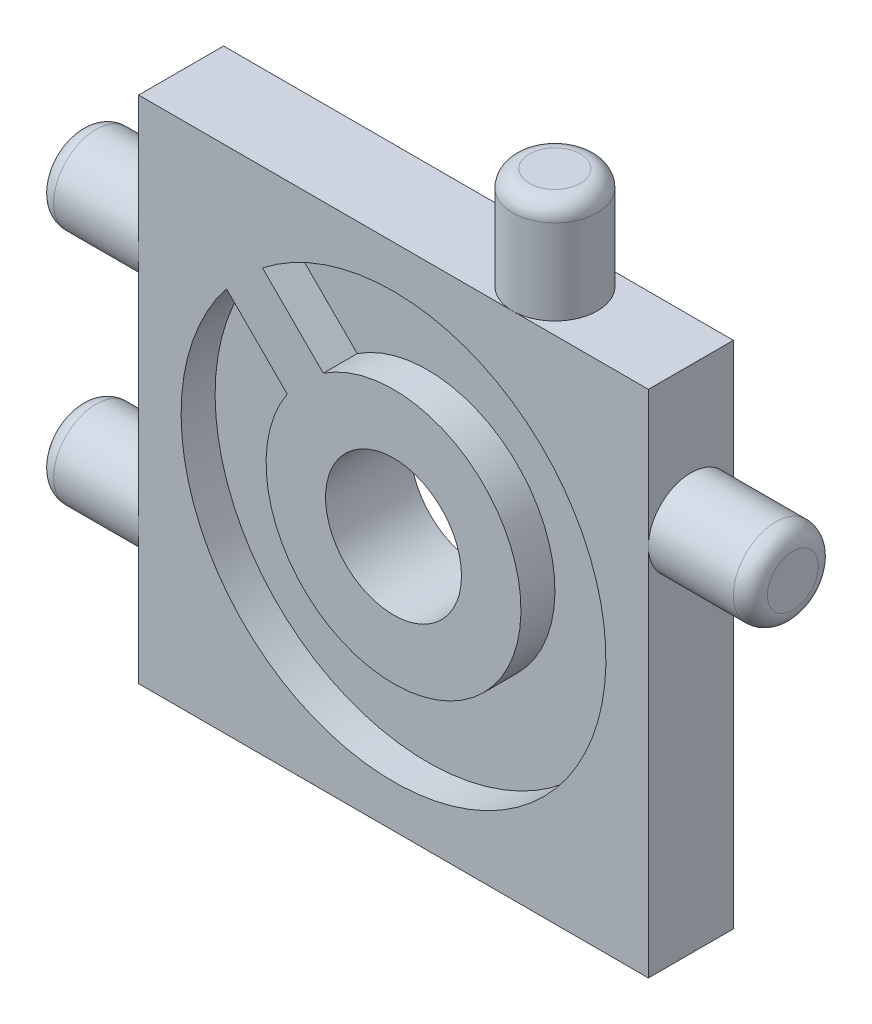
ISO-10303-21;
HEADER;
FILE_DESCRIPTION(('STEP AP214'),'2;1');
FILE_NAME('part.step','',(''),(''),'','','');
FILE_SCHEMA(('AUTOMOTIVE_DESIGN { 1 0 10303 214 1 1 1 1 }'));
ENDSEC;
DATA;
#1=APPLICATION_CONTEXT('core data for automotive mechanical design processes');
#2=APPLICATION_PROTOCOL_DEFINITION('international standard','automotive_design',2000,#1);
#3=PRODUCT_CONTEXT('',#1,'mechanical');
#4=PRODUCT('Part','Part','',(#3));
#5=PRODUCT_RELATED_PRODUCT_CATEGORY('part','',(#4));
#6=PRODUCT_DEFINITION_FORMATION('','',#4);
#7=PRODUCT_DEFINITION_CONTEXT('part definition',#1,'design');
#8=PRODUCT_DEFINITION('design','',#6,#7);
#9=PRODUCT_DEFINITION_SHAPE('','',#8);
#10=(LENGTH_UNIT() NAMED_UNIT(*) SI_UNIT(.MILLI.,.METRE.));
#11=(NAMED_UNIT(*) PLANE_ANGLE_UNIT() SI_UNIT($,.RADIAN.));
#12=(NAMED_UNIT(*) SI_UNIT($,.STERADIAN.) SOLID_ANGLE_UNIT());
#13=UNCERTAINTY_MEASURE_WITH_UNIT(LENGTH_MEASURE(1.E-05),#10,'distance_accuracy_value','');
#14=(GEOMETRIC_REPRESENTATION_CONTEXT(3) GLOBAL_UNCERTAINTY_ASSIGNED_CONTEXT((#13)) GLOBAL_UNIT_ASSIGNED_CONTEXT((#10,
#11,#12)) REPRESENTATION_CONTEXT('',''));
#15=CARTESIAN_POINT('',(0.,0.,0.));
#16=DIRECTION('',(0.,0.,1.));
#17=DIRECTION('',(1.,0.,0.));
#18=AXIS2_PLACEMENT_3D('',#15,#16,#17);
#19=CARTESIAN_POINT('',(0.,0.,0.));
#20=DIRECTION('',(0.,0.,1.));
#21=DIRECTION('',(1.,0.,0.));
#22=AXIS2_PLACEMENT_3D('',#19,#20,#21);
#23=PLANE('',#22);
#24=DIRECTION('',(0.,-1.,0.));
#25=VECTOR('',#24,1.);
#26=CARTESIAN_POINT('',(-15.,15.,0.));
#27=LINE('',#26,#25);
#28=CARTESIAN_POINT('',(-15.,15.,0.));
#29=VERTEX_POINT('',#28);
#30=CARTESIAN_POINT('',(-15.,7.,0.));
#31=VERTEX_POINT('',#30);
#32=EDGE_CURVE('E247',#29,#31,#27,.T.);
#33=ORIENTED_EDGE('',*,*,#32,.F.);
#34=DIRECTION('',(1.,0.,0.));
#35=VECTOR('',#34,1.);
#36=CARTESIAN_POINT('',(-15.,15.,0.));
#37=LINE('',#36,#35);
#38=CARTESIAN_POINT('',(7.,15.,0.));
#39=VERTEX_POINT('',#38);
#40=EDGE_CURVE('E259',#29,#39,#37,.T.);
#41=ORIENTED_EDGE('',*,*,#40,.T.);
#42=CARTESIAN_POINT('',(15.,15.,0.));
#43=VERTEX_POINT('',#42);
#44=EDGE_CURVE('E258',#39,#43,#37,.T.);
#45=ORIENTED_EDGE('',*,*,#44,.T.);
#46=DIRECTION('',(0.,-1.,0.));
#47=VECTOR('',#46,1.);
#48=CARTESIAN_POINT('',(15.,15.,0.));
#49=LINE('',#48,#47);
#50=CARTESIAN_POINT('',(15.,6.99999999999999,0.));
#51=VERTEX_POINT('',#50);
#52=EDGE_CURVE('E255',#43,#51,#49,.T.);
#53=ORIENTED_EDGE('',*,*,#52,.T.);
#54=CARTESIAN_POINT('',(15.,-15.,0.));
#55=VERTEX_POINT('',#54);
#56=EDGE_CURVE('E254',#51,#55,#49,.T.);
#57=ORIENTED_EDGE('',*,*,#56,.T.);
#58=DIRECTION('',(1.,0.,0.));
#59=VECTOR('',#58,1.);
#60=CARTESIAN_POINT('',(-15.,-15.,0.));
#61=LINE('',#60,#59);
#62=CARTESIAN_POINT('',(-15.,-15.,0.));
#63=VERTEX_POINT('',#62);
#64=EDGE_CURVE('E250',#63,#55,#61,.T.);
#65=ORIENTED_EDGE('',*,*,#64,.F.);
#66=CARTESIAN_POINT('',(-15.,-7.,0.));
#67=VERTEX_POINT('',#66);
#68=EDGE_CURVE('E231',#67,#63,#27,.T.);
#69=ORIENTED_EDGE('',*,*,#68,.F.);
#70=EDGE_CURVE('E251',#31,#67,#27,.T.);
#71=ORIENTED_EDGE('',*,*,#70,.F.);
#72=EDGE_LOOP('',(#33,#41,#45,#53,#57,#65,#69,#71));
#73=FACE_BOUND('',#72,.T.);
#74=CARTESIAN_POINT('',(0.,0.,0.));
#75=DIRECTION('',(0.,0.,1.));
#76=DIRECTION('',(1.,0.,0.));
#77=AXIS2_PLACEMENT_3D('',#74,#75,#76);
#78=CIRCLE('',#77,4.);
#79=CARTESIAN_POINT('',(4.,0.,0.));
#80=VERTEX_POINT('',#79);
#81=EDGE_CURVE('E204',#80,#80,#78,.T.);
#82=ORIENTED_EDGE('',*,*,#81,.T.);
#83=EDGE_LOOP('',(#82));
#84=FACE_BOUND('',#83,.T.);
#85=DIRECTION('',(0.707106781186547,0.707106781186548,0.));
#86=VECTOR('',#85,1.);
#87=CARTESIAN_POINT('',(-8.83883476483185,8.83883476483184,0.));
#88=LINE('',#87,#86);
#89=CARTESIAN_POINT('',(-9.89949493661167,7.77817459305202,0.));
#90=VERTEX_POINT('',#89);
#91=CARTESIAN_POINT('',(-7.77817459305202,9.89949493661167,0.));
#92=VERTEX_POINT('',#91);
#93=EDGE_CURVE('E170',#90,#92,#88,.T.);
#94=ORIENTED_EDGE('',*,*,#93,.F.);
#95=DIRECTION('',(0.707106781186548,-0.707106781186547,0.));
#96=VECTOR('',#95,1.);
#97=CARTESIAN_POINT('',(-1.06066017177982,-1.06066017177982,0.));
#98=LINE('',#97,#96);
#99=CARTESIAN_POINT('',(-5.66699296860536,3.54567262504572,0.));
#100=VERTEX_POINT('',#99);
#101=EDGE_CURVE('E183',#90,#100,#98,.T.);
#102=ORIENTED_EDGE('',*,*,#101,.T.);
#103=DIRECTION('',(0.707106781186547,0.707106781186548,0.));
#104=VECTOR('',#103,1.);
#105=CARTESIAN_POINT('',(-4.60633279682554,4.60633279682554,0.));
#106=LINE('',#105,#104);
#107=CARTESIAN_POINT('',(-3.54567262504572,5.66699296860536,0.));
#108=VERTEX_POINT('',#107);
#109=EDGE_CURVE('E186',#100,#108,#106,.T.);
#110=ORIENTED_EDGE('',*,*,#109,.T.);
#111=DIRECTION('',(0.707106781186548,-0.707106781186548,0.));
#112=VECTOR('',#111,1.);
#113=CARTESIAN_POINT('',(1.06066017177982,1.06066017177982,0.));
#114=LINE('',#113,#112);
#115=EDGE_CURVE('E196',#92,#108,#114,.T.);
#116=ORIENTED_EDGE('',*,*,#115,.F.);
#117=EDGE_LOOP('',(#94,#102,#110,#116));
#118=FACE_BOUND('',#117,.T.);
#119=ADVANCED_FACE('F33',(#73,#84,#118),#23,.F.);
#120=CARTESIAN_POINT('',(0.,0.,3.));
#121=DIRECTION('',(0.,0.,1.));
#122=DIRECTION('',(1.,0.,0.));
#123=AXIS2_PLACEMENT_3D('',#120,#121,#122);
#124=CYLINDRICAL_SURFACE('',#123,12.5);
#125=DIRECTION('',(0.,0.,1.));
#126=VECTOR('',#125,1.);
#127=CARTESIAN_POINT('',(-7.7143042156123,9.83562455917194,3.));
#128=LINE('',#127,#126);
#129=CARTESIAN_POINT('',(-7.7143042156123,9.83562455917194,3.));
#130=VERTEX_POINT('',#129);
#131=CARTESIAN_POINT('',(-7.7143042156123,9.83562455917194,5.));
#132=VERTEX_POINT('',#131);
#133=EDGE_CURVE('E194',#130,#132,#128,.T.);
#134=ORIENTED_EDGE('',*,*,#133,.F.);
#135=CARTESIAN_POINT('',(0.,0.,3.));
#136=DIRECTION('',(0.,0.,1.));
#137=DIRECTION('',(1.,0.,0.));
#138=AXIS2_PLACEMENT_3D('',#135,#136,#137);
#139=CIRCLE('',#138,12.5);
#140=CARTESIAN_POINT('',(-9.83562455917194,7.7143042156123,3.));
#141=VERTEX_POINT('',#140);
#142=EDGE_CURVE('E215',#141,#130,#139,.T.);
#143=ORIENTED_EDGE('',*,*,#142,.F.);
#144=DIRECTION('',(0.,0.,1.));
#145=VECTOR('',#144,1.);
#146=CARTESIAN_POINT('',(-9.83562455917194,7.7143042156123,3.));
#147=LINE('',#146,#145);
#148=CARTESIAN_POINT('',(-9.83562455917194,7.7143042156123,5.));
#149=VERTEX_POINT('',#148);
#150=EDGE_CURVE('E180',#141,#149,#147,.T.);
#151=ORIENTED_EDGE('',*,*,#150,.T.);
#152=CARTESIAN_POINT('',(0.,0.,5.));
#153=DIRECTION('',(0.,0.,1.));
#154=DIRECTION('',(1.,0.,0.));
#155=AXIS2_PLACEMENT_3D('',#152,#153,#154);
#156=CIRCLE('',#155,12.5);
#157=EDGE_CURVE('E212',#149,#132,#156,.T.);
#158=ORIENTED_EDGE('',*,*,#157,.T.);
#159=EDGE_LOOP('',(#134,#143,#151,#158));
#160=FACE_BOUND('',#159,.T.);
#161=ADVANCED_FACE('F363',(#160),#124,.F.);
#162=CARTESIAN_POINT('',(0.,0.,3.));
#163=DIRECTION('',(0.,0.,1.));
#164=DIRECTION('',(1.,0.,0.));
#165=AXIS2_PLACEMENT_3D('',#162,#163,#164);
#166=PLANE('',#165);
#167=ORIENTED_EDGE('',*,*,#142,.T.);
#168=DIRECTION('',(0.707106781186548,-0.707106781186548,0.));
#169=VECTOR('',#168,1.);
#170=CARTESIAN_POINT('',(1.06066017177982,1.06066017177982,3.));
#171=LINE('',#170,#169);
#172=CARTESIAN_POINT('',(-4.13549225092681,6.25681259448645,3.));
#173=VERTEX_POINT('',#172);
#174=EDGE_CURVE('E191',#130,#173,#171,.T.);
#175=ORIENTED_EDGE('',*,*,#174,.T.);
#176=CARTESIAN_POINT('',(0.,0.,3.));
#177=DIRECTION('',(0.,0.,1.));
#178=DIRECTION('',(1.,0.,0.));
#179=AXIS2_PLACEMENT_3D('',#176,#177,#178);
#180=CIRCLE('',#179,7.5);
#181=CARTESIAN_POINT('',(-6.25681259448645,4.13549225092681,3.));
#182=VERTEX_POINT('',#181);
#183=EDGE_CURVE('E207',#182,#173,#180,.T.);
#184=ORIENTED_EDGE('',*,*,#183,.F.);
#185=DIRECTION('',(0.707106781186548,-0.707106781186547,0.));
#186=VECTOR('',#185,1.);
#187=CARTESIAN_POINT('',(-1.06066017177982,-1.06066017177982,3.));
#188=LINE('',#187,#186);
#189=EDGE_CURVE('E174',#141,#182,#188,.T.);
#190=ORIENTED_EDGE('',*,*,#189,.F.);
#191=EDGE_LOOP('',(#167,#175,#184,#190));
#192=FACE_BOUND('',#191,.T.);
#193=ADVANCED_FACE('F369',(#192),#166,.T.);
#194=CARTESIAN_POINT('',(0.,0.,5.));
#195=DIRECTION('',(0.,0.,-1.));
#196=DIRECTION('',(-1.,0.,0.));
#197=AXIS2_PLACEMENT_3D('',#194,#195,#196);
#198=CYLINDRICAL_SURFACE('',#197,7.5);
#199=DIRECTION('',(0.,0.,-1.));
#200=VECTOR('',#199,1.);
#201=CARTESIAN_POINT('',(-4.13549225092681,6.25681259448645,5.));
#202=LINE('',#201,#200);
#203=CARTESIAN_POINT('',(-4.13549225092681,6.25681259448646,5.));
#204=VERTEX_POINT('',#203);
#205=EDGE_CURVE('E189',#204,#173,#202,.T.);
#206=ORIENTED_EDGE('',*,*,#205,.F.);
#207=CARTESIAN_POINT('',(0.,0.,5.));
#208=DIRECTION('',(0.,0.,1.));
#209=DIRECTION('',(1.,0.,0.));
#210=AXIS2_PLACEMENT_3D('',#207,#208,#209);
#211=CIRCLE('',#210,7.5);
#212=CARTESIAN_POINT('',(-6.25681259448645,4.13549225092681,5.));
#213=VERTEX_POINT('',#212);
#214=EDGE_CURVE('E210',#213,#204,#211,.T.);
#215=ORIENTED_EDGE('',*,*,#214,.F.);
#216=DIRECTION('',(0.,0.,-1.));
#217=VECTOR('',#216,1.);
#218=CARTESIAN_POINT('',(-6.25681259448645,4.13549225092681,5.));
#219=LINE('',#218,#217);
#220=EDGE_CURVE('E171',#213,#182,#219,.T.);
#221=ORIENTED_EDGE('',*,*,#220,.T.);
#222=ORIENTED_EDGE('',*,*,#183,.T.);
#223=EDGE_LOOP('',(#206,#215,#221,#222));
#224=FACE_BOUND('',#223,.T.);
#225=ADVANCED_FACE('F407',(#224),#198,.T.);
#226=CARTESIAN_POINT('',(-15.,15.,5.));
#227=DIRECTION('',(0.,1.,0.));
#228=DIRECTION('',(0.,0.,1.));
#229=AXIS2_PLACEMENT_3D('',#226,#227,#228);
#230=PLANE('',#229);
#231=CARTESIAN_POINT('',(7.,15.,2.5));
#232=DIRECTION('',(0.,1.,0.));
#233=DIRECTION('',(0.,0.,1.));
#234=AXIS2_PLACEMENT_3D('',#231,#232,#233);
#235=CIRCLE('',#234,2.5);
#236=CARTESIAN_POINT('',(7.,15.,5.));
#237=VERTEX_POINT('',#236);
#238=EDGE_CURVE('E199',#237,#39,#235,.T.);
#239=ORIENTED_EDGE('',*,*,#238,.F.);
#240=DIRECTION('',(1.,0.,0.));
#241=VECTOR('',#240,1.);
#242=CARTESIAN_POINT('',(-15.,15.,5.));
#243=LINE('',#242,#241);
#244=CARTESIAN_POINT('',(15.,15.,5.));
#245=VERTEX_POINT('',#244);
#246=EDGE_CURVE('E243',#237,#245,#243,.T.);
#247=ORIENTED_EDGE('',*,*,#246,.T.);
#248=DIRECTION('',(0.,0.,-1.));
#249=VECTOR('',#248,1.);
#250=CARTESIAN_POINT('',(15.,15.,5.));
#251=LINE('',#250,#249);
#252=EDGE_CURVE('E263',#245,#43,#251,.T.);
#253=ORIENTED_EDGE('',*,*,#252,.T.);
#254=ORIENTED_EDGE('',*,*,#44,.F.);
#255=EDGE_LOOP('',(#239,#247,#253,#254));
#256=FACE_BOUND('',#255,.T.);
#257=ADVANCED_FACE('F303',(#256),#230,.T.);
#258=CARTESIAN_POINT('',(15.,15.,5.));
#259=DIRECTION('',(1.,0.,0.));
#260=DIRECTION('',(0.,1.,0.));
#261=AXIS2_PLACEMENT_3D('',#258,#259,#260);
#262=PLANE('',#261);
#263=CARTESIAN_POINT('',(15.,6.99999999999999,2.5));
#264=DIRECTION('',(1.,0.,0.));
#265=DIRECTION('',(0.,1.,0.));
#266=AXIS2_PLACEMENT_3D('',#263,#264,#265);
#267=CIRCLE('',#266,2.5);
#268=CARTESIAN_POINT('',(15.,6.99999999999999,5.));
#269=VERTEX_POINT('',#268);
#270=EDGE_CURVE('E218',#269,#51,#267,.T.);
#271=ORIENTED_EDGE('',*,*,#270,.F.);
#272=DIRECTION('',(0.,-1.,0.));
#273=VECTOR('',#272,1.);
#274=CARTESIAN_POINT('',(15.,15.,5.));
#275=LINE('',#274,#273);
#276=CARTESIAN_POINT('',(15.,-15.,5.));
#277=VERTEX_POINT('',#276);
#278=EDGE_CURVE('E240',#269,#277,#275,.T.);
#279=ORIENTED_EDGE('',*,*,#278,.T.);
#280=DIRECTION('',(0.,0.,-1.));
#281=VECTOR('',#280,1.);
#282=CARTESIAN_POINT('',(15.,-15.,5.));
#283=LINE('',#282,#281);
#284=EDGE_CURVE('E266',#277,#55,#283,.T.);
#285=ORIENTED_EDGE('',*,*,#284,.T.);
#286=ORIENTED_EDGE('',*,*,#56,.F.);
#287=EDGE_LOOP('',(#271,#279,#285,#286));
#288=FACE_BOUND('',#287,.T.);
#289=ADVANCED_FACE('F339',(#288),#262,.T.);
#290=CARTESIAN_POINT('',(-15.,15.,5.));
#291=DIRECTION('',(1.,0.,0.));
#292=DIRECTION('',(0.,1.,0.));
#293=AXIS2_PLACEMENT_3D('',#290,#291,#292);
#294=PLANE('',#293);
#295=CARTESIAN_POINT('',(-15.,-7.,2.5));
#296=DIRECTION('',(-1.,0.,0.));
#297=DIRECTION('',(0.,-1.,0.));
#298=AXIS2_PLACEMENT_3D('',#295,#296,#297);
#299=CIRCLE('',#298,2.5);
#300=CARTESIAN_POINT('',(-15.,-7.,5.));
#301=VERTEX_POINT('',#300);
#302=EDGE_CURVE('E223',#67,#301,#299,.T.);
#303=ORIENTED_EDGE('',*,*,#302,.F.);
#304=ORIENTED_EDGE('',*,*,#68,.T.);
#305=DIRECTION('',(0.,0.,-1.));
#306=VECTOR('',#305,1.);
#307=CARTESIAN_POINT('',(-15.,-15.,5.));
#308=LINE('',#307,#306);
#309=CARTESIAN_POINT('',(-15.,-15.,5.));
#310=VERTEX_POINT('',#309);
#311=EDGE_CURVE('E269',#310,#63,#308,.T.);
#312=ORIENTED_EDGE('',*,*,#311,.F.);
#313=DIRECTION('',(0.,-1.,0.));
#314=VECTOR('',#313,1.);
#315=CARTESIAN_POINT('',(-15.,15.,5.));
#316=LINE('',#315,#314);
#317=EDGE_CURVE('E237',#301,#310,#316,.T.);
#318=ORIENTED_EDGE('',*,*,#317,.F.);
#319=EDGE_LOOP('',(#303,#304,#312,#318));
#320=FACE_BOUND('',#319,.T.);
#321=ADVANCED_FACE('F334',(#320),#294,.F.);
#322=CARTESIAN_POINT('',(-15.,7.,2.5));
#323=DIRECTION('',(-1.,0.,0.));
#324=DIRECTION('',(0.,-1.,0.));
#325=AXIS2_PLACEMENT_3D('',#322,#323,#324);
#326=CIRCLE('',#325,2.5);
#327=CARTESIAN_POINT('',(-15.,7.,5.));
#328=VERTEX_POINT('',#327);
#329=EDGE_CURVE('E228',#328,#31,#326,.T.);
#330=ORIENTED_EDGE('',*,*,#329,.F.);
#331=CARTESIAN_POINT('',(-15.,15.,5.));
#332=VERTEX_POINT('',#331);
#333=EDGE_CURVE('E233',#332,#328,#316,.T.);
#334=ORIENTED_EDGE('',*,*,#333,.F.);
#335=DIRECTION('',(0.,0.,-1.));
#336=VECTOR('',#335,1.);
#337=CARTESIAN_POINT('',(-15.,15.,5.));
#338=LINE('',#337,#336);
#339=EDGE_CURVE('E246',#332,#29,#338,.T.);
#340=ORIENTED_EDGE('',*,*,#339,.T.);
#341=ORIENTED_EDGE('',*,*,#32,.T.);
#342=EDGE_LOOP('',(#330,#334,#340,#341));
#343=FACE_BOUND('',#342,.T.);
#344=ADVANCED_FACE('F313',(#343),#294,.F.);
#345=EDGE_CURVE('E225',#301,#67,#299,.T.);
#346=ORIENTED_EDGE('',*,*,#345,.F.);
#347=EDGE_CURVE('E236',#328,#301,#316,.T.);
#348=ORIENTED_EDGE('',*,*,#347,.F.);
#349=EDGE_CURVE('E232',#31,#328,#326,.T.);
#350=ORIENTED_EDGE('',*,*,#349,.F.);
#351=ORIENTED_EDGE('',*,*,#70,.T.);
#352=EDGE_LOOP('',(#346,#348,#350,#351));
#353=FACE_BOUND('',#352,.T.);
#354=ADVANCED_FACE('F320',(#353),#294,.F.);
#355=CARTESIAN_POINT('',(-15.,-15.,5.));
#356=DIRECTION('',(0.,1.,0.));
#357=DIRECTION('',(0.,0.,1.));
#358=AXIS2_PLACEMENT_3D('',#355,#356,#357);
#359=PLANE('',#358);
#360=ORIENTED_EDGE('',*,*,#64,.T.);
#361=ORIENTED_EDGE('',*,*,#284,.F.);
#362=DIRECTION('',(1.,0.,0.));
#363=VECTOR('',#362,1.);
#364=CARTESIAN_POINT('',(-15.,-15.,5.));
#365=LINE('',#364,#363);
#366=EDGE_CURVE('E235',#310,#277,#365,.T.);
#367=ORIENTED_EDGE('',*,*,#366,.F.);
#368=ORIENTED_EDGE('',*,*,#311,.T.);
#369=EDGE_LOOP('',(#360,#361,#367,#368));
#370=FACE_BOUND('',#369,.T.);
#371=ADVANCED_FACE('F333',(#370),#359,.F.);
#372=EDGE_CURVE('E224',#51,#269,#267,.T.);
#373=ORIENTED_EDGE('',*,*,#372,.F.);
#374=ORIENTED_EDGE('',*,*,#52,.F.);
#375=ORIENTED_EDGE('',*,*,#252,.F.);
#376=EDGE_CURVE('E241',#245,#269,#275,.T.);
#377=ORIENTED_EDGE('',*,*,#376,.T.);
#378=EDGE_LOOP('',(#373,#374,#375,#377));
#379=FACE_BOUND('',#378,.T.);
#380=ADVANCED_FACE('F343',(#379),#262,.T.);
#381=EDGE_CURVE('E203',#39,#237,#235,.T.);
#382=ORIENTED_EDGE('',*,*,#381,.F.);
#383=ORIENTED_EDGE('',*,*,#40,.F.);
#384=ORIENTED_EDGE('',*,*,#339,.F.);
#385=EDGE_CURVE('E244',#332,#237,#243,.T.);
#386=ORIENTED_EDGE('',*,*,#385,.T.);
#387=EDGE_LOOP('',(#382,#383,#384,#386));
#388=FACE_BOUND('',#387,.T.);
#389=ADVANCED_FACE('F299',(#388),#230,.T.);
#390=CARTESIAN_POINT('',(0.,0.,5.));
#391=DIRECTION('',(0.,0.,1.));
#392=DIRECTION('',(1.,0.,0.));
#393=AXIS2_PLACEMENT_3D('',#390,#391,#392);
#394=PLANE('',#393);
#395=DIRECTION('',(0.707106781186547,-0.707106781186547,0.));
#396=VECTOR('',#395,1.);
#397=CARTESIAN_POINT('',(-7.77817459305202,9.89949493661167,5.));
#398=LINE('',#397,#396);
#399=EDGE_CURVE('E422',#132,#204,#398,.T.);
#400=ORIENTED_EDGE('',*,*,#399,.F.);
#401=ORIENTED_EDGE('',*,*,#157,.F.);
#402=DIRECTION('',(0.707106781186548,-0.707106781186547,0.));
#403=VECTOR('',#402,1.);
#404=CARTESIAN_POINT('',(-9.89949493661167,7.77817459305202,5.));
#405=LINE('',#404,#403);
#406=EDGE_CURVE('E56',#149,#213,#405,.T.);
#407=ORIENTED_EDGE('',*,*,#406,.T.);
#408=ORIENTED_EDGE('',*,*,#214,.T.);
#409=EDGE_LOOP('',(#400,#401,#407,#408));
#410=FACE_BOUND('',#409,.T.);
#411=CARTESIAN_POINT('',(0.,0.,5.));
#412=DIRECTION('',(0.,0.,1.));
#413=DIRECTION('',(1.,0.,0.));
#414=AXIS2_PLACEMENT_3D('',#411,#412,#413);
#415=CIRCLE('',#414,4.);
#416=CARTESIAN_POINT('',(4.,0.,5.));
#417=VERTEX_POINT('',#416);
#418=EDGE_CURVE('E202',#417,#417,#415,.T.);
#419=ORIENTED_EDGE('',*,*,#418,.F.);
#420=EDGE_LOOP('',(#419));
#421=FACE_BOUND('',#420,.T.);
#422=ORIENTED_EDGE('',*,*,#333,.T.);
#423=ORIENTED_EDGE('',*,*,#347,.T.);
#424=ORIENTED_EDGE('',*,*,#317,.T.);
#425=ORIENTED_EDGE('',*,*,#366,.T.);
#426=ORIENTED_EDGE('',*,*,#278,.F.);
#427=ORIENTED_EDGE('',*,*,#376,.F.);
#428=ORIENTED_EDGE('',*,*,#246,.F.);
#429=ORIENTED_EDGE('',*,*,#385,.F.);
#430=EDGE_LOOP('',(#422,#423,#424,#425,#426,#427,#428,#429));
#431=FACE_BOUND('',#430,.T.);
#432=ADVANCED_FACE('F326',(#410,#421,#431),#394,.T.);
#433=CARTESIAN_POINT('',(-21.,6.99999999999999,2.5));
#434=DIRECTION('',(1.,0.,0.));
#435=DIRECTION('',(0.,1.,0.));
#436=AXIS2_PLACEMENT_3D('',#433,#434,#435);
#437=CYLINDRICAL_SURFACE('',#436,2.5);
#438=CARTESIAN_POINT('',(-20.,6.99999999999999,2.5));
#439=DIRECTION('',(-1.,0.,0.));
#440=DIRECTION('',(0.,-1.,0.));
#441=AXIS2_PLACEMENT_3D('',#438,#439,#440);
#442=CIRCLE('',#441,2.5);
#443=CARTESIAN_POINT('',(-20.,4.5,2.5));
#444=VERTEX_POINT('',#443);
#445=EDGE_CURVE('E281',#444,#444,#442,.F.);
#446=ORIENTED_EDGE('',*,*,#445,.T.);
#447=EDGE_LOOP('',(#446));
#448=FACE_BOUND('',#447,.T.);
#449=ORIENTED_EDGE('',*,*,#329,.T.);
#450=ORIENTED_EDGE('',*,*,#349,.T.);
#451=EDGE_LOOP('',(#449,#450));
#452=FACE_BOUND('',#451,.T.);
#453=ADVANCED_FACE('F317',(#448,#452),#437,.T.);
#454=CARTESIAN_POINT('',(-21.,6.99999999999999,2.5));
#455=DIRECTION('',(-1.,0.,0.));
#456=DIRECTION('',(0.,-1.,0.));
#457=AXIS2_PLACEMENT_3D('',#454,#455,#456);
#458=PLANE('',#457);
#459=CARTESIAN_POINT('',(-21.,6.99999999999999,2.5));
#460=DIRECTION('',(-1.,0.,0.));
#461=DIRECTION('',(0.,-1.,0.));
#462=AXIS2_PLACEMENT_3D('',#459,#460,#461);
#463=CIRCLE('',#462,1.5);
#464=CARTESIAN_POINT('',(-21.,5.49999999999999,2.5));
#465=VERTEX_POINT('',#464);
#466=EDGE_CURVE('E278',#465,#465,#463,.T.);
#467=ORIENTED_EDGE('',*,*,#466,.T.);
#468=EDGE_LOOP('',(#467));
#469=FACE_BOUND('',#468,.T.);
#470=ADVANCED_FACE('F598',(#469),#458,.T.);
#471=CARTESIAN_POINT('',(-21.,-7.,2.5));
#472=DIRECTION('',(1.,0.,0.));
#473=DIRECTION('',(0.,1.,0.));
#474=AXIS2_PLACEMENT_3D('',#471,#472,#473);
#475=CYLINDRICAL_SURFACE('',#474,2.5);
#476=CARTESIAN_POINT('',(-20.,-7.,2.5));
#477=DIRECTION('',(-1.,0.,0.));
#478=DIRECTION('',(0.,-1.,0.));
#479=AXIS2_PLACEMENT_3D('',#476,#477,#478);
#480=CIRCLE('',#479,2.5);
#481=CARTESIAN_POINT('',(-20.,-9.5,2.5));
#482=VERTEX_POINT('',#481);
#483=EDGE_CURVE('E275',#482,#482,#480,.F.);
#484=ORIENTED_EDGE('',*,*,#483,.T.);
#485=EDGE_LOOP('',(#484));
#486=FACE_BOUND('',#485,.T.);
#487=ORIENTED_EDGE('',*,*,#345,.T.);
#488=ORIENTED_EDGE('',*,*,#302,.T.);
#489=EDGE_LOOP('',(#487,#488));
#490=FACE_BOUND('',#489,.T.);
#491=ADVANCED_FACE('F590',(#486,#490),#475,.T.);
#492=CARTESIAN_POINT('',(-21.,-7.,2.5));
#493=DIRECTION('',(-1.,0.,0.));
#494=DIRECTION('',(0.,-1.,0.));
#495=AXIS2_PLACEMENT_3D('',#492,#493,#494);
#496=PLANE('',#495);
#497=CARTESIAN_POINT('',(-21.,-7.,2.5));
#498=DIRECTION('',(-1.,0.,0.));
#499=DIRECTION('',(0.,-1.,0.));
#500=AXIS2_PLACEMENT_3D('',#497,#498,#499);
#501=CIRCLE('',#500,1.5);
#502=CARTESIAN_POINT('',(-21.,-8.5,2.5));
#503=VERTEX_POINT('',#502);
#504=EDGE_CURVE('E272',#503,#503,#501,.T.);
#505=ORIENTED_EDGE('',*,*,#504,.T.);
#506=EDGE_LOOP('',(#505));
#507=FACE_BOUND('',#506,.T.);
#508=ADVANCED_FACE('F384',(#507),#496,.T.);
#509=CARTESIAN_POINT('',(-20.,-7.,2.5));
#510=DIRECTION('',(-1.,0.,0.));
#511=DIRECTION('',(0.,-1.,0.));
#512=AXIS2_PLACEMENT_3D('',#509,#510,#511);
#513=TOROIDAL_SURFACE('',#512,1.5,1.);
#514=ORIENTED_EDGE('',*,*,#483,.F.);
#515=EDGE_LOOP('',(#514));
#516=FACE_BOUND('',#515,.T.);
#517=ORIENTED_EDGE('',*,*,#504,.F.);
#518=EDGE_LOOP('',(#517));
#519=FACE_BOUND('',#518,.T.);
#520=ADVANCED_FACE('F358',(#516,#519),#513,.T.);
#521=CARTESIAN_POINT('',(-20.,6.99999999999999,2.5));
#522=DIRECTION('',(-1.,0.,0.));
#523=DIRECTION('',(0.,-1.,0.));
#524=AXIS2_PLACEMENT_3D('',#521,#522,#523);
#525=TOROIDAL_SURFACE('',#524,1.5,1.);
#526=ORIENTED_EDGE('',*,*,#445,.F.);
#527=EDGE_LOOP('',(#526));
#528=FACE_BOUND('',#527,.T.);
#529=ORIENTED_EDGE('',*,*,#466,.F.);
#530=EDGE_LOOP('',(#529));
#531=FACE_BOUND('',#530,.T.);
#532=ADVANCED_FACE('F348',(#528,#531),#525,.T.);
#533=CARTESIAN_POINT('',(21.,6.99999999999999,2.5));
#534=DIRECTION('',(-1.,0.,0.));
#535=DIRECTION('',(0.,-1.,0.));
#536=AXIS2_PLACEMENT_3D('',#533,#534,#535);
#537=CYLINDRICAL_SURFACE('',#536,2.5);
#538=CARTESIAN_POINT('',(20.,6.99999999999999,2.5));
#539=DIRECTION('',(1.,0.,0.));
#540=DIRECTION('',(0.,1.,0.));
#541=AXIS2_PLACEMENT_3D('',#538,#539,#540);
#542=CIRCLE('',#541,2.5);
#543=CARTESIAN_POINT('',(20.,9.5,2.5));
#544=VERTEX_POINT('',#543);
#545=EDGE_CURVE('E287',#544,#544,#542,.F.);
#546=ORIENTED_EDGE('',*,*,#545,.T.);
#547=EDGE_LOOP('',(#546));
#548=FACE_BOUND('',#547,.T.);
#549=ORIENTED_EDGE('',*,*,#270,.T.);
#550=ORIENTED_EDGE('',*,*,#372,.T.);
#551=EDGE_LOOP('',(#549,#550));
#552=FACE_BOUND('',#551,.T.);
#553=ADVANCED_FACE('F345',(#548,#552),#537,.T.);
#554=CARTESIAN_POINT('',(21.,6.99999999999999,2.5));
#555=DIRECTION('',(1.,0.,0.));
#556=DIRECTION('',(0.,1.,0.));
#557=AXIS2_PLACEMENT_3D('',#554,#555,#556);
#558=PLANE('',#557);
#559=CARTESIAN_POINT('',(21.,6.99999999999999,2.5));
#560=DIRECTION('',(1.,0.,0.));
#561=DIRECTION('',(0.,1.,0.));
#562=AXIS2_PLACEMENT_3D('',#559,#560,#561);
#563=CIRCLE('',#562,1.5);
#564=CARTESIAN_POINT('',(21.,8.5,2.5));
#565=VERTEX_POINT('',#564);
#566=EDGE_CURVE('E284',#565,#565,#563,.T.);
#567=ORIENTED_EDGE('',*,*,#566,.T.);
#568=EDGE_LOOP('',(#567));
#569=FACE_BOUND('',#568,.T.);
#570=ADVANCED_FACE('F347',(#569),#558,.T.);
#571=CARTESIAN_POINT('',(20.,6.99999999999999,2.5));
#572=DIRECTION('',(1.,0.,0.));
#573=DIRECTION('',(0.,1.,0.));
#574=AXIS2_PLACEMENT_3D('',#571,#572,#573);
#575=TOROIDAL_SURFACE('',#574,1.5,1.);
#576=ORIENTED_EDGE('',*,*,#545,.F.);
#577=EDGE_LOOP('',(#576));
#578=FACE_BOUND('',#577,.T.);
#579=ORIENTED_EDGE('',*,*,#566,.F.);
#580=EDGE_LOOP('',(#579));
#581=FACE_BOUND('',#580,.T.);
#582=ADVANCED_FACE('F355',(#578,#581),#575,.T.);
#583=CARTESIAN_POINT('',(0.,0.,0.));
#584=DIRECTION('',(0.,0.,1.));
#585=DIRECTION('',(1.,0.,0.));
#586=AXIS2_PLACEMENT_3D('',#583,#584,#585);
#587=CYLINDRICAL_SURFACE('',#586,4.);
#588=ORIENTED_EDGE('',*,*,#81,.F.);
#589=EDGE_LOOP('',(#588));
#590=FACE_BOUND('',#589,.T.);
#591=ORIENTED_EDGE('',*,*,#418,.T.);
#592=EDGE_LOOP('',(#591));
#593=FACE_BOUND('',#592,.T.);
#594=ADVANCED_FACE('F387',(#590,#593),#587,.F.);
#595=CARTESIAN_POINT('',(7.,21.,2.5));
#596=DIRECTION('',(0.,-1.,0.));
#597=DIRECTION('',(0.,0.,-1.));
#598=AXIS2_PLACEMENT_3D('',#595,#596,#597);
#599=CYLINDRICAL_SURFACE('',#598,2.5);
#600=CARTESIAN_POINT('',(7.,20.,2.5));
#601=DIRECTION('',(0.,1.,0.));
#602=DIRECTION('',(0.,0.,1.));
#603=AXIS2_PLACEMENT_3D('',#600,#601,#602);
#604=CIRCLE('',#603,2.5);
#605=CARTESIAN_POINT('',(7.,20.,5.));
#606=VERTEX_POINT('',#605);
#607=EDGE_CURVE('E11',#606,#606,#604,.F.);
#608=ORIENTED_EDGE('',*,*,#607,.T.);
#609=EDGE_LOOP('',(#608));
#610=FACE_BOUND('',#609,.T.);
#611=ORIENTED_EDGE('',*,*,#238,.T.);
#612=ORIENTED_EDGE('',*,*,#381,.T.);
#613=EDGE_LOOP('',(#611,#612));
#614=FACE_BOUND('',#613,.T.);
#615=ADVANCED_FACE('F294',(#610,#614),#599,.T.);
#616=CARTESIAN_POINT('',(7.,21.,2.5));
#617=DIRECTION('',(0.,1.,0.));
#618=DIRECTION('',(0.,0.,1.));
#619=AXIS2_PLACEMENT_3D('',#616,#617,#618);
#620=PLANE('',#619);
#621=CARTESIAN_POINT('',(7.,21.,2.5));
#622=DIRECTION('',(0.,1.,0.));
#623=DIRECTION('',(0.,0.,1.));
#624=AXIS2_PLACEMENT_3D('',#621,#622,#623);
#625=CIRCLE('',#624,1.5);
#626=CARTESIAN_POINT('',(7.,21.,4.));
#627=VERTEX_POINT('',#626);
#628=EDGE_CURVE('E41',#627,#627,#625,.T.);
#629=ORIENTED_EDGE('',*,*,#628,.T.);
#630=EDGE_LOOP('',(#629));
#631=FACE_BOUND('',#630,.T.);
#632=ADVANCED_FACE('F400',(#631),#620,.T.);
#633=CARTESIAN_POINT('',(7.,20.,2.5));
#634=DIRECTION('',(0.,1.,0.));
#635=DIRECTION('',(0.,0.,1.));
#636=AXIS2_PLACEMENT_3D('',#633,#634,#635);
#637=TOROIDAL_SURFACE('',#636,1.5,1.);
#638=ORIENTED_EDGE('',*,*,#607,.F.);
#639=EDGE_LOOP('',(#638));
#640=FACE_BOUND('',#639,.T.);
#641=ORIENTED_EDGE('',*,*,#628,.F.);
#642=EDGE_LOOP('',(#641));
#643=FACE_BOUND('',#642,.T.);
#644=ADVANCED_FACE('F35',(#640,#643),#637,.T.);
#645=CARTESIAN_POINT('',(-9.89949493661167,7.77817459305202,-2.5));
#646=DIRECTION('',(-0.707106781186547,-0.707106781186548,0.));
#647=DIRECTION('',(0.707106781186548,-0.707106781186547,0.));
#648=AXIS2_PLACEMENT_3D('',#645,#646,#647);
#649=PLANE('',#648);
#650=ORIENTED_EDGE('',*,*,#150,.F.);
#651=ORIENTED_EDGE('',*,*,#189,.T.);
#652=ORIENTED_EDGE('',*,*,#220,.F.);
#653=ORIENTED_EDGE('',*,*,#406,.F.);
#654=EDGE_LOOP('',(#650,#651,#652,#653));
#655=FACE_BOUND('',#654,.T.);
#656=ADVANCED_FACE('F438',(#655),#649,.T.);
#657=CARTESIAN_POINT('',(-7.77817459305202,9.89949493661167,-2.5));
#658=DIRECTION('',(-0.707106781186548,-0.707106781186548,0.));
#659=DIRECTION('',(0.707106781186548,-0.707106781186548,0.));
#660=AXIS2_PLACEMENT_3D('',#657,#658,#659);
#661=PLANE('',#660);
#662=ORIENTED_EDGE('',*,*,#174,.F.);
#663=ORIENTED_EDGE('',*,*,#133,.T.);
#664=ORIENTED_EDGE('',*,*,#399,.T.);
#665=ORIENTED_EDGE('',*,*,#205,.T.);
#666=EDGE_LOOP('',(#662,#663,#664,#665));
#667=FACE_BOUND('',#666,.T.);
#668=ADVANCED_FACE('F421',(#667),#661,.F.);
#669=CARTESIAN_POINT('',(-9.89949493661167,7.77817459305202,-2.5));
#670=DIRECTION('',(0.707106781186548,-0.707106781186547,0.));
#671=DIRECTION('',(0.707106781186547,0.707106781186548,0.));
#672=AXIS2_PLACEMENT_3D('',#669,#670,#671);
#673=PLANE('',#672);
#674=DIRECTION('',(0.,0.,1.));
#675=VECTOR('',#674,1.);
#676=CARTESIAN_POINT('',(-9.89949493661167,7.77817459305202,-2.5));
#677=LINE('',#676,#675);
#678=CARTESIAN_POINT('',(-9.89949493661167,7.77817459305202,-2.5));
#679=VERTEX_POINT('',#678);
#680=EDGE_CURVE('E431',#679,#90,#677,.T.);
#681=ORIENTED_EDGE('',*,*,#680,.T.);
#682=ORIENTED_EDGE('',*,*,#93,.T.);
#683=DIRECTION('',(0.,0.,1.));
#684=VECTOR('',#683,1.);
#685=CARTESIAN_POINT('',(-7.77817459305202,9.89949493661167,-2.5));
#686=LINE('',#685,#684);
#687=CARTESIAN_POINT('',(-7.77817459305202,9.89949493661167,-2.5));
#688=VERTEX_POINT('',#687);
#689=EDGE_CURVE('E151',#688,#92,#686,.T.);
#690=ORIENTED_EDGE('',*,*,#689,.F.);
#691=DIRECTION('',(0.707106781186547,0.707106781186548,0.));
#692=VECTOR('',#691,1.);
#693=CARTESIAN_POINT('',(-9.89949493661167,7.77817459305202,-2.5));
#694=LINE('',#693,#692);
#695=EDGE_CURVE('E159',#679,#688,#694,.T.);
#696=ORIENTED_EDGE('',*,*,#695,.F.);
#697=EDGE_LOOP('',(#681,#682,#690,#696));
#698=FACE_BOUND('',#697,.T.);
#699=ADVANCED_FACE('F168',(#698),#673,.F.);
#700=ORIENTED_EDGE('',*,*,#689,.T.);
#701=ORIENTED_EDGE('',*,*,#115,.T.);
#702=DIRECTION('',(0.,0.,1.));
#703=VECTOR('',#702,1.);
#704=CARTESIAN_POINT('',(-3.54567262504572,5.66699296860536,-2.5));
#705=LINE('',#704,#703);
#706=CARTESIAN_POINT('',(-3.54567262504572,5.66699296860536,-2.5));
#707=VERTEX_POINT('',#706);
#708=EDGE_CURVE('E154',#707,#108,#705,.T.);
#709=ORIENTED_EDGE('',*,*,#708,.F.);
#710=DIRECTION('',(0.707106781186547,-0.707106781186547,0.));
#711=VECTOR('',#710,1.);
#712=CARTESIAN_POINT('',(-7.77817459305202,9.89949493661167,-2.5));
#713=LINE('',#712,#711);
#714=EDGE_CURVE('E147',#688,#707,#713,.T.);
#715=ORIENTED_EDGE('',*,*,#714,.F.);
#716=EDGE_LOOP('',(#700,#701,#709,#715));
#717=FACE_BOUND('',#716,.T.);
#718=ADVANCED_FACE('F149',(#717),#661,.F.);
#719=CARTESIAN_POINT('',(-5.66699296860536,3.54567262504572,-2.5));
#720=DIRECTION('',(0.707106781186548,-0.707106781186547,0.));
#721=DIRECTION('',(0.707106781186547,0.707106781186548,0.));
#722=AXIS2_PLACEMENT_3D('',#719,#720,#721);
#723=PLANE('',#722);
#724=ORIENTED_EDGE('',*,*,#109,.F.);
#725=DIRECTION('',(0.,0.,1.));
#726=VECTOR('',#725,1.);
#727=CARTESIAN_POINT('',(-5.66699296860536,3.54567262504572,-2.5));
#728=LINE('',#727,#726);
#729=CARTESIAN_POINT('',(-5.66699296860536,3.54567262504572,-2.5));
#730=VERTEX_POINT('',#729);
#731=EDGE_CURVE('E48',#730,#100,#728,.T.);
#732=ORIENTED_EDGE('',*,*,#731,.F.);
#733=DIRECTION('',(0.707106781186547,0.707106781186548,0.));
#734=VECTOR('',#733,1.);
#735=CARTESIAN_POINT('',(-5.66699296860536,3.54567262504572,-2.5));
#736=LINE('',#735,#734);
#737=EDGE_CURVE('E158',#730,#707,#736,.T.);
#738=ORIENTED_EDGE('',*,*,#737,.T.);
#739=ORIENTED_EDGE('',*,*,#708,.T.);
#740=EDGE_LOOP('',(#724,#732,#738,#739));
#741=FACE_BOUND('',#740,.T.);
#742=ADVANCED_FACE('F434',(#741),#723,.T.);
#743=ORIENTED_EDGE('',*,*,#101,.F.);
#744=ORIENTED_EDGE('',*,*,#680,.F.);
#745=DIRECTION('',(0.707106781186548,-0.707106781186547,0.));
#746=VECTOR('',#745,1.);
#747=CARTESIAN_POINT('',(-9.89949493661167,7.77817459305202,-2.5));
#748=LINE('',#747,#746);
#749=EDGE_CURVE('E164',#679,#730,#748,.T.);
#750=ORIENTED_EDGE('',*,*,#749,.T.);
#751=ORIENTED_EDGE('',*,*,#731,.T.);
#752=EDGE_LOOP('',(#743,#744,#750,#751));
#753=FACE_BOUND('',#752,.T.);
#754=ADVANCED_FACE('F435',(#753),#649,.T.);
#755=CARTESIAN_POINT('',(0.,0.,-2.5));
#756=DIRECTION('',(0.,0.,-1.));
#757=DIRECTION('',(-1.,0.,0.));
#758=AXIS2_PLACEMENT_3D('',#755,#756,#757);
#759=PLANE('',#758);
#760=ORIENTED_EDGE('',*,*,#695,.T.);
#761=ORIENTED_EDGE('',*,*,#714,.T.);
#762=ORIENTED_EDGE('',*,*,#737,.F.);
#763=ORIENTED_EDGE('',*,*,#749,.F.);
#764=EDGE_LOOP('',(#760,#761,#762,#763));
#765=FACE_BOUND('',#764,.T.);
#766=ADVANCED_FACE('F163',(#765),#759,.T.);
#767=CLOSED_SHELL('',(#119,#161,#193,#225,#257,#289,#321,#344,#354,#371,#380,#389,#432,#453,
#470,#491,#508,#520,#532,#553,#570,#582,#594,#615,#632,#644,#656,#668,#699,#718,#742,#754,#766));
#768=MANIFOLD_SOLID_BREP('B2',#767);
#769=ADVANCED_BREP_SHAPE_REPRESENTATION('',(#18,#768),#14);
#770=SHAPE_DEFINITION_REPRESENTATION(#9,#769);
ENDSEC;
END-ISO-10303-21;
